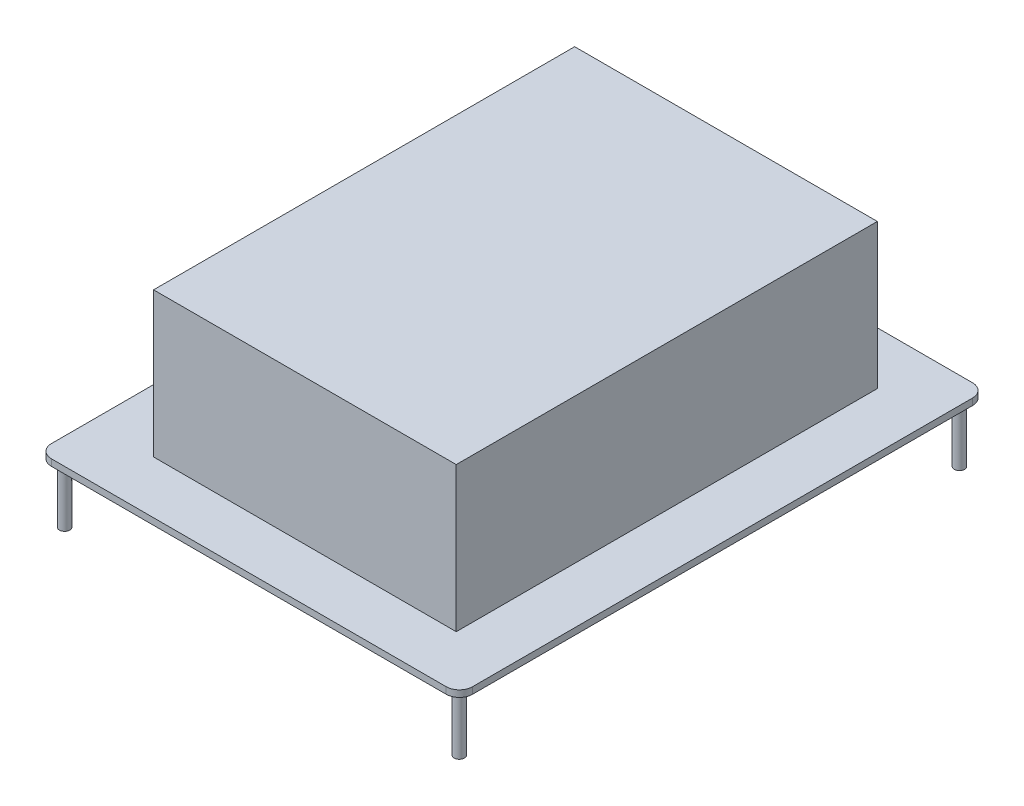
ISO-10303-21;
HEADER;
FILE_DESCRIPTION(('STEP AP214'),'2;1');
FILE_NAME('part.step','',(''),(''),'','','');
FILE_SCHEMA(('AUTOMOTIVE_DESIGN { 1 0 10303 214 1 1 1 1 }'));
ENDSEC;
DATA;
#1=APPLICATION_CONTEXT('core data for automotive mechanical design processes');
#2=APPLICATION_PROTOCOL_DEFINITION('international standard','automotive_design',2000,#1);
#3=PRODUCT_CONTEXT('',#1,'mechanical');
#4=PRODUCT('Part','Part','',(#3));
#5=PRODUCT_RELATED_PRODUCT_CATEGORY('part','',(#4));
#6=PRODUCT_DEFINITION_FORMATION('','',#4);
#7=PRODUCT_DEFINITION_CONTEXT('part definition',#1,'design');
#8=PRODUCT_DEFINITION('design','',#6,#7);
#9=PRODUCT_DEFINITION_SHAPE('','',#8);
#10=(LENGTH_UNIT() NAMED_UNIT(*) SI_UNIT(.MILLI.,.METRE.));
#11=(NAMED_UNIT(*) PLANE_ANGLE_UNIT() SI_UNIT($,.RADIAN.));
#12=(NAMED_UNIT(*) SI_UNIT($,.STERADIAN.) SOLID_ANGLE_UNIT());
#13=UNCERTAINTY_MEASURE_WITH_UNIT(LENGTH_MEASURE(1.E-05),#10,'distance_accuracy_value','');
#14=(GEOMETRIC_REPRESENTATION_CONTEXT(3) GLOBAL_UNCERTAINTY_ASSIGNED_CONTEXT((#13)) GLOBAL_UNIT_ASSIGNED_CONTEXT((#10,
#11,#12)) REPRESENTATION_CONTEXT('',''));
#15=CARTESIAN_POINT('',(0.,0.,0.));
#16=DIRECTION('',(0.,0.,1.));
#17=DIRECTION('',(1.,0.,0.));
#18=AXIS2_PLACEMENT_3D('',#15,#16,#17);
#19=CARTESIAN_POINT('',(0.,1.27,0.));
#20=DIRECTION('',(0.,-1.,0.));
#21=DIRECTION('',(0.,0.,-1.));
#22=AXIS2_PLACEMENT_3D('',#19,#20,#21);
#23=PLANE('',#22);
#24=DIRECTION('',(-1.,0.,0.));
#25=VECTOR('',#24,1.);
#26=CARTESIAN_POINT('',(-40.64,1.27,-50.8));
#27=LINE('',#26,#25);
#28=CARTESIAN_POINT('',(38.1,1.27,-50.8));
#29=VERTEX_POINT('',#28);
#30=CARTESIAN_POINT('',(-38.1,1.27,-50.8));
#31=VERTEX_POINT('',#30);
#32=EDGE_CURVE('E160',#29,#31,#27,.T.);
#33=ORIENTED_EDGE('',*,*,#32,.T.);
#34=CARTESIAN_POINT('',(-38.1,1.27,-48.26));
#35=DIRECTION('',(0.,-1.,0.));
#36=DIRECTION('',(0.,0.,-1.));
#37=AXIS2_PLACEMENT_3D('',#34,#35,#36);
#38=CIRCLE('',#37,2.54);
#39=CARTESIAN_POINT('',(-40.64,1.27,-48.26));
#40=VERTEX_POINT('',#39);
#41=EDGE_CURVE('E197',#31,#40,#38,.F.);
#42=ORIENTED_EDGE('',*,*,#41,.T.);
#43=DIRECTION('',(0.,0.,1.));
#44=VECTOR('',#43,1.);
#45=CARTESIAN_POINT('',(-40.64,1.27,50.8));
#46=LINE('',#45,#44);
#47=CARTESIAN_POINT('',(-40.64,1.27,48.26));
#48=VERTEX_POINT('',#47);
#49=EDGE_CURVE('E164',#40,#48,#46,.T.);
#50=ORIENTED_EDGE('',*,*,#49,.T.);
#51=CARTESIAN_POINT('',(-38.1,1.27,48.26));
#52=DIRECTION('',(0.,-1.,0.));
#53=DIRECTION('',(0.,0.,-1.));
#54=AXIS2_PLACEMENT_3D('',#51,#52,#53);
#55=CIRCLE('',#54,2.54);
#56=CARTESIAN_POINT('',(-38.1,1.27,50.8));
#57=VERTEX_POINT('',#56);
#58=EDGE_CURVE('E54',#48,#57,#55,.F.);
#59=ORIENTED_EDGE('',*,*,#58,.T.);
#60=DIRECTION('',(1.,0.,0.));
#61=VECTOR('',#60,1.);
#62=CARTESIAN_POINT('',(-40.64,1.27,50.8));
#63=LINE('',#62,#61);
#64=CARTESIAN_POINT('',(38.1,1.27,50.8));
#65=VERTEX_POINT('',#64);
#66=EDGE_CURVE('E166',#57,#65,#63,.T.);
#67=ORIENTED_EDGE('',*,*,#66,.T.);
#68=CARTESIAN_POINT('',(38.1,1.27,48.26));
#69=DIRECTION('',(0.,-1.,0.));
#70=DIRECTION('',(0.,0.,-1.));
#71=AXIS2_PLACEMENT_3D('',#68,#69,#70);
#72=CIRCLE('',#71,2.54);
#73=CARTESIAN_POINT('',(40.64,1.27,48.26));
#74=VERTEX_POINT('',#73);
#75=EDGE_CURVE('E193',#65,#74,#72,.F.);
#76=ORIENTED_EDGE('',*,*,#75,.T.);
#77=DIRECTION('',(0.,0.,-1.));
#78=VECTOR('',#77,1.);
#79=CARTESIAN_POINT('',(40.64,1.27,50.8));
#80=LINE('',#79,#78);
#81=CARTESIAN_POINT('',(40.64,1.27,-48.26));
#82=VERTEX_POINT('',#81);
#83=EDGE_CURVE('E157',#74,#82,#80,.T.);
#84=ORIENTED_EDGE('',*,*,#83,.T.);
#85=CARTESIAN_POINT('',(38.1,1.27,-48.26));
#86=DIRECTION('',(0.,-1.,0.));
#87=DIRECTION('',(0.,0.,-1.));
#88=AXIS2_PLACEMENT_3D('',#85,#86,#87);
#89=CIRCLE('',#88,2.54);
#90=EDGE_CURVE('E195',#82,#29,#89,.F.);
#91=ORIENTED_EDGE('',*,*,#90,.T.);
#92=EDGE_LOOP('',(#33,#42,#50,#59,#67,#76,#84,#91));
#93=FACE_BOUND('',#92,.T.);
#94=DIRECTION('',(0.,0.,1.));
#95=VECTOR('',#94,1.);
#96=CARTESIAN_POINT('',(-28.5428672215424,1.27,-40.64));
#97=LINE('',#96,#95);
#98=CARTESIAN_POINT('',(-28.5428672215424,1.27,-40.64));
#99=VERTEX_POINT('',#98);
#100=CARTESIAN_POINT('',(-28.5428672215424,1.27,40.64));
#101=VERTEX_POINT('',#100);
#102=EDGE_CURVE('E147',#99,#101,#97,.T.);
#103=ORIENTED_EDGE('',*,*,#102,.F.);
#104=DIRECTION('',(-1.,0.,0.));
#105=VECTOR('',#104,1.);
#106=CARTESIAN_POINT('',(-28.5428672215424,1.27,-40.64));
#107=LINE('',#106,#105);
#108=CARTESIAN_POINT('',(29.8771327784576,1.27,-40.64));
#109=VERTEX_POINT('',#108);
#110=EDGE_CURVE('E144',#109,#99,#107,.T.);
#111=ORIENTED_EDGE('',*,*,#110,.F.);
#112=DIRECTION('',(0.,0.,-1.));
#113=VECTOR('',#112,1.);
#114=CARTESIAN_POINT('',(29.8771327784576,1.27,-40.64));
#115=LINE('',#114,#113);
#116=CARTESIAN_POINT('',(29.8771327784576,1.27,40.64));
#117=VERTEX_POINT('',#116);
#118=EDGE_CURVE('E444',#117,#109,#115,.T.);
#119=ORIENTED_EDGE('',*,*,#118,.F.);
#120=DIRECTION('',(1.,0.,0.));
#121=VECTOR('',#120,1.);
#122=CARTESIAN_POINT('',(-28.5428672215424,1.27,40.64));
#123=LINE('',#122,#121);
#124=EDGE_CURVE('E446',#101,#117,#123,.T.);
#125=ORIENTED_EDGE('',*,*,#124,.F.);
#126=EDGE_LOOP('',(#103,#111,#119,#125));
#127=FACE_BOUND('',#126,.T.);
#128=ADVANCED_FACE('F34',(#93,#127),#23,.F.);
#129=CARTESIAN_POINT('',(40.64,1.27,50.8));
#130=DIRECTION('',(-1.,0.,0.));
#131=DIRECTION('',(0.,0.,1.));
#132=AXIS2_PLACEMENT_3D('',#129,#130,#131);
#133=PLANE('',#132);
#134=DIRECTION('',(0.,0.,-1.));
#135=VECTOR('',#134,1.);
#136=CARTESIAN_POINT('',(40.64,0.,50.8));
#137=LINE('',#136,#135);
#138=CARTESIAN_POINT('',(40.64,0.,48.26));
#139=VERTEX_POINT('',#138);
#140=CARTESIAN_POINT('',(40.64,0.,-48.26));
#141=VERTEX_POINT('',#140);
#142=EDGE_CURVE('E148',#139,#141,#137,.T.);
#143=ORIENTED_EDGE('',*,*,#142,.T.);
#144=DIRECTION('',(0.,-1.,0.));
#145=VECTOR('',#144,1.);
#146=CARTESIAN_POINT('',(40.64,1.27,-48.26));
#147=LINE('',#146,#145);
#148=EDGE_CURVE('E202',#141,#82,#147,.F.);
#149=ORIENTED_EDGE('',*,*,#148,.T.);
#150=ORIENTED_EDGE('',*,*,#83,.F.);
#151=DIRECTION('',(0.,-1.,0.));
#152=VECTOR('',#151,1.);
#153=CARTESIAN_POINT('',(40.64,1.27,48.26));
#154=LINE('',#153,#152);
#155=EDGE_CURVE('E199',#74,#139,#154,.T.);
#156=ORIENTED_EDGE('',*,*,#155,.T.);
#157=EDGE_LOOP('',(#143,#149,#150,#156));
#158=FACE_BOUND('',#157,.T.);
#159=ADVANCED_FACE('F218',(#158),#133,.F.);
#160=CARTESIAN_POINT('',(-40.64,1.27,-50.8));
#161=DIRECTION('',(0.,0.,1.));
#162=DIRECTION('',(1.,0.,0.));
#163=AXIS2_PLACEMENT_3D('',#160,#161,#162);
#164=PLANE('',#163);
#165=DIRECTION('',(-1.,0.,0.));
#166=VECTOR('',#165,1.);
#167=CARTESIAN_POINT('',(-40.64,0.,-50.8));
#168=LINE('',#167,#166);
#169=CARTESIAN_POINT('',(38.1,0.,-50.8));
#170=VERTEX_POINT('',#169);
#171=CARTESIAN_POINT('',(-38.1,0.,-50.8));
#172=VERTEX_POINT('',#171);
#173=EDGE_CURVE('E151',#170,#172,#168,.T.);
#174=ORIENTED_EDGE('',*,*,#173,.T.);
#175=DIRECTION('',(0.,-1.,0.));
#176=VECTOR('',#175,1.);
#177=CARTESIAN_POINT('',(-38.1,1.27,-50.8));
#178=LINE('',#177,#176);
#179=EDGE_CURVE('E190',#172,#31,#178,.F.);
#180=ORIENTED_EDGE('',*,*,#179,.T.);
#181=ORIENTED_EDGE('',*,*,#32,.F.);
#182=DIRECTION('',(0.,-1.,0.));
#183=VECTOR('',#182,1.);
#184=CARTESIAN_POINT('',(38.1,1.27,-50.8));
#185=LINE('',#184,#183);
#186=EDGE_CURVE('E187',#29,#170,#185,.T.);
#187=ORIENTED_EDGE('',*,*,#186,.T.);
#188=EDGE_LOOP('',(#174,#180,#181,#187));
#189=FACE_BOUND('',#188,.T.);
#190=ADVANCED_FACE('F228',(#189),#164,.F.);
#191=CARTESIAN_POINT('',(-40.64,1.27,50.8));
#192=DIRECTION('',(1.,0.,0.));
#193=DIRECTION('',(0.,0.,-1.));
#194=AXIS2_PLACEMENT_3D('',#191,#192,#193);
#195=PLANE('',#194);
#196=ORIENTED_EDGE('',*,*,#49,.F.);
#197=DIRECTION('',(0.,-1.,0.));
#198=VECTOR('',#197,1.);
#199=CARTESIAN_POINT('',(-40.64,1.27,-48.26));
#200=LINE('',#199,#198);
#201=CARTESIAN_POINT('',(-40.64,0.,-48.26));
#202=VERTEX_POINT('',#201);
#203=EDGE_CURVE('E176',#40,#202,#200,.T.);
#204=ORIENTED_EDGE('',*,*,#203,.T.);
#205=DIRECTION('',(0.,0.,1.));
#206=VECTOR('',#205,1.);
#207=CARTESIAN_POINT('',(-40.64,0.,50.8));
#208=LINE('',#207,#206);
#209=CARTESIAN_POINT('',(-40.64,0.,48.26));
#210=VERTEX_POINT('',#209);
#211=EDGE_CURVE('E171',#202,#210,#208,.T.);
#212=ORIENTED_EDGE('',*,*,#211,.T.);
#213=DIRECTION('',(0.,-1.,0.));
#214=VECTOR('',#213,1.);
#215=CARTESIAN_POINT('',(-40.64,1.27,48.26));
#216=LINE('',#215,#214);
#217=EDGE_CURVE('E167',#210,#48,#216,.F.);
#218=ORIENTED_EDGE('',*,*,#217,.T.);
#219=EDGE_LOOP('',(#196,#204,#212,#218));
#220=FACE_BOUND('',#219,.T.);
#221=ADVANCED_FACE('F236',(#220),#195,.F.);
#222=CARTESIAN_POINT('',(-40.64,1.27,50.8));
#223=DIRECTION('',(0.,0.,-1.));
#224=DIRECTION('',(-1.,0.,0.));
#225=AXIS2_PLACEMENT_3D('',#222,#223,#224);
#226=PLANE('',#225);
#227=DIRECTION('',(1.,0.,0.));
#228=VECTOR('',#227,1.);
#229=CARTESIAN_POINT('',(-40.64,0.,50.8));
#230=LINE('',#229,#228);
#231=CARTESIAN_POINT('',(-38.1,0.,50.8));
#232=VERTEX_POINT('',#231);
#233=CARTESIAN_POINT('',(38.1,0.,50.8));
#234=VERTEX_POINT('',#233);
#235=EDGE_CURVE('E161',#232,#234,#230,.T.);
#236=ORIENTED_EDGE('',*,*,#235,.T.);
#237=DIRECTION('',(0.,-1.,0.));
#238=VECTOR('',#237,1.);
#239=CARTESIAN_POINT('',(38.1,1.27,50.8));
#240=LINE('',#239,#238);
#241=EDGE_CURVE('E11',#234,#65,#240,.F.);
#242=ORIENTED_EDGE('',*,*,#241,.T.);
#243=ORIENTED_EDGE('',*,*,#66,.F.);
#244=DIRECTION('',(0.,-1.,0.));
#245=VECTOR('',#244,1.);
#246=CARTESIAN_POINT('',(-38.1,1.27,50.8));
#247=LINE('',#246,#245);
#248=EDGE_CURVE('E42',#57,#232,#247,.T.);
#249=ORIENTED_EDGE('',*,*,#248,.T.);
#250=EDGE_LOOP('',(#236,#242,#243,#249));
#251=FACE_BOUND('',#250,.T.);
#252=ADVANCED_FACE('F206',(#251),#226,.F.);
#253=CARTESIAN_POINT('',(0.,0.,0.));
#254=DIRECTION('',(0.,-1.,0.));
#255=DIRECTION('',(0.,0.,-1.));
#256=AXIS2_PLACEMENT_3D('',#253,#254,#255);
#257=PLANE('',#256);
#258=CARTESIAN_POINT('',(-38.1,0.,-48.26));
#259=DIRECTION('',(0.,-1.,0.));
#260=DIRECTION('',(0.,0.,-1.));
#261=AXIS2_PLACEMENT_3D('',#258,#259,#260);
#262=CIRCLE('',#261,0.999999999999998);
#263=CARTESIAN_POINT('',(-38.1,0.,-49.26));
#264=VERTEX_POINT('',#263);
#265=EDGE_CURVE('E476',#264,#264,#262,.T.);
#266=ORIENTED_EDGE('',*,*,#265,.F.);
#267=EDGE_LOOP('',(#266));
#268=FACE_BOUND('',#267,.T.);
#269=CARTESIAN_POINT('',(-38.1,0.,48.26));
#270=DIRECTION('',(0.,-1.,0.));
#271=DIRECTION('',(0.,0.,1.));
#272=AXIS2_PLACEMENT_3D('',#269,#270,#271);
#273=CIRCLE('',#272,0.999999999999998);
#274=CARTESIAN_POINT('',(-38.1,0.,49.26));
#275=VERTEX_POINT('',#274);
#276=EDGE_CURVE('E470',#275,#275,#273,.T.);
#277=ORIENTED_EDGE('',*,*,#276,.F.);
#278=EDGE_LOOP('',(#277));
#279=FACE_BOUND('',#278,.T.);
#280=CARTESIAN_POINT('',(38.1,0.,-48.26));
#281=DIRECTION('',(0.,-1.,0.));
#282=DIRECTION('',(0.,0.,1.));
#283=AXIS2_PLACEMENT_3D('',#280,#281,#282);
#284=CIRCLE('',#283,0.999999999999998);
#285=CARTESIAN_POINT('',(38.1,0.,-47.26));
#286=VERTEX_POINT('',#285);
#287=EDGE_CURVE('E464',#286,#286,#284,.T.);
#288=ORIENTED_EDGE('',*,*,#287,.F.);
#289=EDGE_LOOP('',(#288));
#290=FACE_BOUND('',#289,.T.);
#291=CARTESIAN_POINT('',(38.1,0.,48.26));
#292=DIRECTION('',(0.,-1.,0.));
#293=DIRECTION('',(0.,0.,-1.));
#294=AXIS2_PLACEMENT_3D('',#291,#292,#293);
#295=CIRCLE('',#294,0.999999999999998);
#296=CARTESIAN_POINT('',(38.1,0.,47.26));
#297=VERTEX_POINT('',#296);
#298=EDGE_CURVE('E458',#297,#297,#295,.T.);
#299=ORIENTED_EDGE('',*,*,#298,.F.);
#300=EDGE_LOOP('',(#299));
#301=FACE_BOUND('',#300,.T.);
#302=ORIENTED_EDGE('',*,*,#211,.F.);
#303=CARTESIAN_POINT('',(-38.1,0.,-48.26));
#304=DIRECTION('',(0.,-1.,0.));
#305=DIRECTION('',(0.,0.,-1.));
#306=AXIS2_PLACEMENT_3D('',#303,#304,#305);
#307=CIRCLE('',#306,2.54);
#308=EDGE_CURVE('E185',#202,#172,#307,.T.);
#309=ORIENTED_EDGE('',*,*,#308,.T.);
#310=ORIENTED_EDGE('',*,*,#173,.F.);
#311=CARTESIAN_POINT('',(38.1,0.,-48.26));
#312=DIRECTION('',(0.,-1.,0.));
#313=DIRECTION('',(0.,0.,-1.));
#314=AXIS2_PLACEMENT_3D('',#311,#312,#313);
#315=CIRCLE('',#314,2.54);
#316=EDGE_CURVE('E183',#170,#141,#315,.T.);
#317=ORIENTED_EDGE('',*,*,#316,.T.);
#318=ORIENTED_EDGE('',*,*,#142,.F.);
#319=CARTESIAN_POINT('',(38.1,0.,48.26));
#320=DIRECTION('',(0.,-1.,0.));
#321=DIRECTION('',(0.,0.,-1.));
#322=AXIS2_PLACEMENT_3D('',#319,#320,#321);
#323=CIRCLE('',#322,2.54);
#324=EDGE_CURVE('E181',#139,#234,#323,.T.);
#325=ORIENTED_EDGE('',*,*,#324,.T.);
#326=ORIENTED_EDGE('',*,*,#235,.F.);
#327=CARTESIAN_POINT('',(-38.1,0.,48.26));
#328=DIRECTION('',(0.,-1.,0.));
#329=DIRECTION('',(0.,0.,-1.));
#330=AXIS2_PLACEMENT_3D('',#327,#328,#329);
#331=CIRCLE('',#330,2.54);
#332=EDGE_CURVE('E179',#232,#210,#331,.T.);
#333=ORIENTED_EDGE('',*,*,#332,.T.);
#334=EDGE_LOOP('',(#302,#309,#310,#317,#318,#325,#326,#333));
#335=FACE_BOUND('',#334,.T.);
#336=ADVANCED_FACE('F210',(#268,#279,#290,#301,#335),#257,.T.);
#337=CARTESIAN_POINT('',(-28.5428672215424,29.21,-40.64));
#338=DIRECTION('',(1.,0.,0.));
#339=DIRECTION('',(0.,0.,-1.));
#340=AXIS2_PLACEMENT_3D('',#337,#338,#339);
#341=PLANE('',#340);
#342=ORIENTED_EDGE('',*,*,#102,.T.);
#343=DIRECTION('',(0.,-1.,0.));
#344=VECTOR('',#343,1.);
#345=CARTESIAN_POINT('',(-28.5428672215424,29.21,40.64));
#346=LINE('',#345,#344);
#347=CARTESIAN_POINT('',(-28.5428672215424,29.21,40.64));
#348=VERTEX_POINT('',#347);
#349=EDGE_CURVE('E128',#348,#101,#346,.T.);
#350=ORIENTED_EDGE('',*,*,#349,.F.);
#351=DIRECTION('',(0.,0.,1.));
#352=VECTOR('',#351,1.);
#353=CARTESIAN_POINT('',(-28.5428672215424,29.21,-40.64));
#354=LINE('',#353,#352);
#355=CARTESIAN_POINT('',(-28.5428672215424,29.21,-40.64));
#356=VERTEX_POINT('',#355);
#357=EDGE_CURVE('E135',#356,#348,#354,.T.);
#358=ORIENTED_EDGE('',*,*,#357,.F.);
#359=DIRECTION('',(0.,-1.,0.));
#360=VECTOR('',#359,1.);
#361=CARTESIAN_POINT('',(-28.5428672215424,29.21,-40.64));
#362=LINE('',#361,#360);
#363=EDGE_CURVE('E449',#356,#99,#362,.T.);
#364=ORIENTED_EDGE('',*,*,#363,.T.);
#365=EDGE_LOOP('',(#342,#350,#358,#364));
#366=FACE_BOUND('',#365,.T.);
#367=ADVANCED_FACE('F146',(#366),#341,.F.);
#368=CARTESIAN_POINT('',(-28.5428672215424,29.21,40.64));
#369=DIRECTION('',(0.,0.,-1.));
#370=DIRECTION('',(-1.,0.,0.));
#371=AXIS2_PLACEMENT_3D('',#368,#369,#370);
#372=PLANE('',#371);
#373=ORIENTED_EDGE('',*,*,#124,.T.);
#374=DIRECTION('',(0.,-1.,0.));
#375=VECTOR('',#374,1.);
#376=CARTESIAN_POINT('',(29.8771327784576,29.21,40.64));
#377=LINE('',#376,#375);
#378=CARTESIAN_POINT('',(29.8771327784576,29.21,40.64));
#379=VERTEX_POINT('',#378);
#380=EDGE_CURVE('E131',#379,#117,#377,.T.);
#381=ORIENTED_EDGE('',*,*,#380,.F.);
#382=DIRECTION('',(1.,0.,0.));
#383=VECTOR('',#382,1.);
#384=CARTESIAN_POINT('',(-28.5428672215424,29.21,40.64));
#385=LINE('',#384,#383);
#386=EDGE_CURVE('E123',#348,#379,#385,.T.);
#387=ORIENTED_EDGE('',*,*,#386,.F.);
#388=ORIENTED_EDGE('',*,*,#349,.T.);
#389=EDGE_LOOP('',(#373,#381,#387,#388));
#390=FACE_BOUND('',#389,.T.);
#391=ADVANCED_FACE('F126',(#390),#372,.F.);
#392=CARTESIAN_POINT('',(29.8771327784576,29.21,-40.64));
#393=DIRECTION('',(-1.,0.,0.));
#394=DIRECTION('',(0.,0.,1.));
#395=AXIS2_PLACEMENT_3D('',#392,#393,#394);
#396=PLANE('',#395);
#397=ORIENTED_EDGE('',*,*,#118,.T.);
#398=DIRECTION('',(0.,-1.,0.));
#399=VECTOR('',#398,1.);
#400=CARTESIAN_POINT('',(29.8771327784576,29.21,-40.64));
#401=LINE('',#400,#399);
#402=CARTESIAN_POINT('',(29.8771327784576,29.21,-40.64));
#403=VERTEX_POINT('',#402);
#404=EDGE_CURVE('E153',#403,#109,#401,.T.);
#405=ORIENTED_EDGE('',*,*,#404,.F.);
#406=DIRECTION('',(0.,0.,-1.));
#407=VECTOR('',#406,1.);
#408=CARTESIAN_POINT('',(29.8771327784576,29.21,-40.64));
#409=LINE('',#408,#407);
#410=EDGE_CURVE('E134',#379,#403,#409,.T.);
#411=ORIENTED_EDGE('',*,*,#410,.F.);
#412=ORIENTED_EDGE('',*,*,#380,.T.);
#413=EDGE_LOOP('',(#397,#405,#411,#412));
#414=FACE_BOUND('',#413,.T.);
#415=ADVANCED_FACE('F375',(#414),#396,.F.);
#416=CARTESIAN_POINT('',(-28.5428672215424,29.21,-40.64));
#417=DIRECTION('',(0.,0.,1.));
#418=DIRECTION('',(1.,0.,0.));
#419=AXIS2_PLACEMENT_3D('',#416,#417,#418);
#420=PLANE('',#419);
#421=ORIENTED_EDGE('',*,*,#110,.T.);
#422=ORIENTED_EDGE('',*,*,#363,.F.);
#423=DIRECTION('',(-1.,0.,0.));
#424=VECTOR('',#423,1.);
#425=CARTESIAN_POINT('',(-28.5428672215424,29.21,-40.64));
#426=LINE('',#425,#424);
#427=EDGE_CURVE('E140',#403,#356,#426,.T.);
#428=ORIENTED_EDGE('',*,*,#427,.F.);
#429=ORIENTED_EDGE('',*,*,#404,.T.);
#430=EDGE_LOOP('',(#421,#422,#428,#429));
#431=FACE_BOUND('',#430,.T.);
#432=ADVANCED_FACE('F372',(#431),#420,.F.);
#433=CARTESIAN_POINT('',(0.,29.21,0.));
#434=DIRECTION('',(0.,1.,0.));
#435=DIRECTION('',(0.,0.,1.));
#436=AXIS2_PLACEMENT_3D('',#433,#434,#435);
#437=PLANE('',#436);
#438=ORIENTED_EDGE('',*,*,#357,.T.);
#439=ORIENTED_EDGE('',*,*,#386,.T.);
#440=ORIENTED_EDGE('',*,*,#410,.T.);
#441=ORIENTED_EDGE('',*,*,#427,.T.);
#442=EDGE_LOOP('',(#438,#439,#440,#441));
#443=FACE_BOUND('',#442,.T.);
#444=ADVANCED_FACE('F138',(#443),#437,.T.);
#445=CARTESIAN_POINT('',(-38.1,1.27,-48.26));
#446=DIRECTION('',(0.,-1.,0.));
#447=DIRECTION('',(0.,0.,-1.));
#448=AXIS2_PLACEMENT_3D('',#445,#446,#447);
#449=CYLINDRICAL_SURFACE('',#448,2.54);
#450=ORIENTED_EDGE('',*,*,#41,.F.);
#451=ORIENTED_EDGE('',*,*,#179,.F.);
#452=ORIENTED_EDGE('',*,*,#308,.F.);
#453=ORIENTED_EDGE('',*,*,#203,.F.);
#454=EDGE_LOOP('',(#450,#451,#452,#453));
#455=FACE_BOUND('',#454,.T.);
#456=ADVANCED_FACE('F233',(#455),#449,.T.);
#457=CARTESIAN_POINT('',(38.1,1.27,-48.26));
#458=DIRECTION('',(0.,-1.,0.));
#459=DIRECTION('',(0.,0.,-1.));
#460=AXIS2_PLACEMENT_3D('',#457,#458,#459);
#461=CYLINDRICAL_SURFACE('',#460,2.54);
#462=ORIENTED_EDGE('',*,*,#90,.F.);
#463=ORIENTED_EDGE('',*,*,#148,.F.);
#464=ORIENTED_EDGE('',*,*,#316,.F.);
#465=ORIENTED_EDGE('',*,*,#186,.F.);
#466=EDGE_LOOP('',(#462,#463,#464,#465));
#467=FACE_BOUND('',#466,.T.);
#468=ADVANCED_FACE('F225',(#467),#461,.T.);
#469=CARTESIAN_POINT('',(38.1,1.27,48.26));
#470=DIRECTION('',(0.,-1.,0.));
#471=DIRECTION('',(0.,0.,-1.));
#472=AXIS2_PLACEMENT_3D('',#469,#470,#471);
#473=CYLINDRICAL_SURFACE('',#472,2.54);
#474=ORIENTED_EDGE('',*,*,#75,.F.);
#475=ORIENTED_EDGE('',*,*,#241,.F.);
#476=ORIENTED_EDGE('',*,*,#324,.F.);
#477=ORIENTED_EDGE('',*,*,#155,.F.);
#478=EDGE_LOOP('',(#474,#475,#476,#477));
#479=FACE_BOUND('',#478,.T.);
#480=ADVANCED_FACE('F215',(#479),#473,.T.);
#481=CARTESIAN_POINT('',(-38.1,1.27,48.26));
#482=DIRECTION('',(0.,-1.,0.));
#483=DIRECTION('',(0.,0.,-1.));
#484=AXIS2_PLACEMENT_3D('',#481,#482,#483);
#485=CYLINDRICAL_SURFACE('',#484,2.54);
#486=ORIENTED_EDGE('',*,*,#58,.F.);
#487=ORIENTED_EDGE('',*,*,#217,.F.);
#488=ORIENTED_EDGE('',*,*,#332,.F.);
#489=ORIENTED_EDGE('',*,*,#248,.F.);
#490=EDGE_LOOP('',(#486,#487,#488,#489));
#491=FACE_BOUND('',#490,.T.);
#492=ADVANCED_FACE('F36',(#491),#485,.T.);
#493=CARTESIAN_POINT('',(38.1,-11.43,48.26));
#494=DIRECTION('',(0.,1.,0.));
#495=DIRECTION('',(0.,0.,1.));
#496=AXIS2_PLACEMENT_3D('',#493,#494,#495);
#497=CYLINDRICAL_SURFACE('',#496,0.999999999999998);
#498=CARTESIAN_POINT('',(38.1,-11.43,48.26));
#499=DIRECTION('',(0.,-1.,0.));
#500=DIRECTION('',(0.,0.,-1.));
#501=AXIS2_PLACEMENT_3D('',#498,#499,#500);
#502=CIRCLE('',#501,0.999999999999998);
#503=CARTESIAN_POINT('',(38.1,-11.43,47.26));
#504=VERTEX_POINT('',#503);
#505=EDGE_CURVE('E455',#504,#504,#502,.T.);
#506=ORIENTED_EDGE('',*,*,#505,.F.);
#507=EDGE_LOOP('',(#506));
#508=FACE_BOUND('',#507,.T.);
#509=ORIENTED_EDGE('',*,*,#298,.T.);
#510=EDGE_LOOP('',(#509));
#511=FACE_BOUND('',#510,.T.);
#512=ADVANCED_FACE('F239',(#508,#511),#497,.T.);
#513=CARTESIAN_POINT('',(38.1,-11.43,48.26));
#514=DIRECTION('',(0.,-1.,0.));
#515=DIRECTION('',(0.,0.,-1.));
#516=AXIS2_PLACEMENT_3D('',#513,#514,#515);
#517=PLANE('',#516);
#518=ORIENTED_EDGE('',*,*,#505,.T.);
#519=EDGE_LOOP('',(#518));
#520=FACE_BOUND('',#519,.T.);
#521=ADVANCED_FACE('F244',(#520),#517,.T.);
#522=CARTESIAN_POINT('',(38.1,-11.43,-48.26));
#523=DIRECTION('',(0.,1.,0.));
#524=DIRECTION('',(0.,0.,1.));
#525=AXIS2_PLACEMENT_3D('',#522,#523,#524);
#526=CYLINDRICAL_SURFACE('',#525,0.999999999999998);
#527=CARTESIAN_POINT('',(38.1,-11.43,-48.26));
#528=DIRECTION('',(0.,-1.,0.));
#529=DIRECTION('',(0.,0.,1.));
#530=AXIS2_PLACEMENT_3D('',#527,#528,#529);
#531=CIRCLE('',#530,0.999999999999998);
#532=CARTESIAN_POINT('',(38.1,-11.43,-47.26));
#533=VERTEX_POINT('',#532);
#534=EDGE_CURVE('E461',#533,#533,#531,.T.);
#535=ORIENTED_EDGE('',*,*,#534,.F.);
#536=EDGE_LOOP('',(#535));
#537=FACE_BOUND('',#536,.T.);
#538=ORIENTED_EDGE('',*,*,#287,.T.);
#539=EDGE_LOOP('',(#538));
#540=FACE_BOUND('',#539,.T.);
#541=ADVANCED_FACE('F305',(#537,#540),#526,.T.);
#542=CARTESIAN_POINT('',(38.1,-11.43,-48.26));
#543=DIRECTION('',(0.,1.,0.));
#544=DIRECTION('',(0.,0.,1.));
#545=AXIS2_PLACEMENT_3D('',#542,#543,#544);
#546=PLANE('',#545);
#547=ORIENTED_EDGE('',*,*,#534,.T.);
#548=EDGE_LOOP('',(#547));
#549=FACE_BOUND('',#548,.T.);
#550=ADVANCED_FACE('F315',(#549),#546,.F.);
#551=CARTESIAN_POINT('',(-38.1,-11.43,48.26));
#552=DIRECTION('',(0.,1.,0.));
#553=DIRECTION('',(0.,0.,1.));
#554=AXIS2_PLACEMENT_3D('',#551,#552,#553);
#555=CYLINDRICAL_SURFACE('',#554,0.999999999999998);
#556=CARTESIAN_POINT('',(-38.1,-11.43,48.26));
#557=DIRECTION('',(0.,-1.,0.));
#558=DIRECTION('',(0.,0.,1.));
#559=AXIS2_PLACEMENT_3D('',#556,#557,#558);
#560=CIRCLE('',#559,0.999999999999998);
#561=CARTESIAN_POINT('',(-38.1,-11.43,49.26));
#562=VERTEX_POINT('',#561);
#563=EDGE_CURVE('E467',#562,#562,#560,.T.);
#564=ORIENTED_EDGE('',*,*,#563,.F.);
#565=EDGE_LOOP('',(#564));
#566=FACE_BOUND('',#565,.T.);
#567=ORIENTED_EDGE('',*,*,#276,.T.);
#568=EDGE_LOOP('',(#567));
#569=FACE_BOUND('',#568,.T.);
#570=ADVANCED_FACE('F325',(#566,#569),#555,.T.);
#571=CARTESIAN_POINT('',(-38.1,-11.43,48.26));
#572=DIRECTION('',(0.,1.,0.));
#573=DIRECTION('',(0.,0.,1.));
#574=AXIS2_PLACEMENT_3D('',#571,#572,#573);
#575=PLANE('',#574);
#576=ORIENTED_EDGE('',*,*,#563,.T.);
#577=EDGE_LOOP('',(#576));
#578=FACE_BOUND('',#577,.T.);
#579=ADVANCED_FACE('F335',(#578),#575,.F.);
#580=CARTESIAN_POINT('',(-38.1,-11.43,-48.26));
#581=DIRECTION('',(0.,1.,0.));
#582=DIRECTION('',(0.,0.,1.));
#583=AXIS2_PLACEMENT_3D('',#580,#581,#582);
#584=CYLINDRICAL_SURFACE('',#583,0.999999999999998);
#585=CARTESIAN_POINT('',(-38.1,-11.43,-48.26));
#586=DIRECTION('',(0.,-1.,0.));
#587=DIRECTION('',(0.,0.,-1.));
#588=AXIS2_PLACEMENT_3D('',#585,#586,#587);
#589=CIRCLE('',#588,0.999999999999998);
#590=CARTESIAN_POINT('',(-38.1,-11.43,-49.26));
#591=VERTEX_POINT('',#590);
#592=EDGE_CURVE('E473',#591,#591,#589,.T.);
#593=ORIENTED_EDGE('',*,*,#592,.F.);
#594=EDGE_LOOP('',(#593));
#595=FACE_BOUND('',#594,.T.);
#596=ORIENTED_EDGE('',*,*,#265,.T.);
#597=EDGE_LOOP('',(#596));
#598=FACE_BOUND('',#597,.T.);
#599=ADVANCED_FACE('F345',(#595,#598),#584,.T.);
#600=CARTESIAN_POINT('',(-38.1,-11.43,-48.26));
#601=DIRECTION('',(0.,-1.,0.));
#602=DIRECTION('',(0.,0.,-1.));
#603=AXIS2_PLACEMENT_3D('',#600,#601,#602);
#604=PLANE('',#603);
#605=ORIENTED_EDGE('',*,*,#592,.T.);
#606=EDGE_LOOP('',(#605));
#607=FACE_BOUND('',#606,.T.);
#608=ADVANCED_FACE('F355',(#607),#604,.T.);
#609=CLOSED_SHELL('',(#128,#159,#190,#221,#252,#336,#367,#391,#415,#432,#444,#456,#468,#480,
#492,#512,#521,#541,#550,#570,#579,#599,#608));
#610=MANIFOLD_SOLID_BREP('B2',#609);
#611=ADVANCED_BREP_SHAPE_REPRESENTATION('',(#18,#610),#14);
#612=SHAPE_DEFINITION_REPRESENTATION(#9,#611);
ENDSEC;
END-ISO-10303-21;
